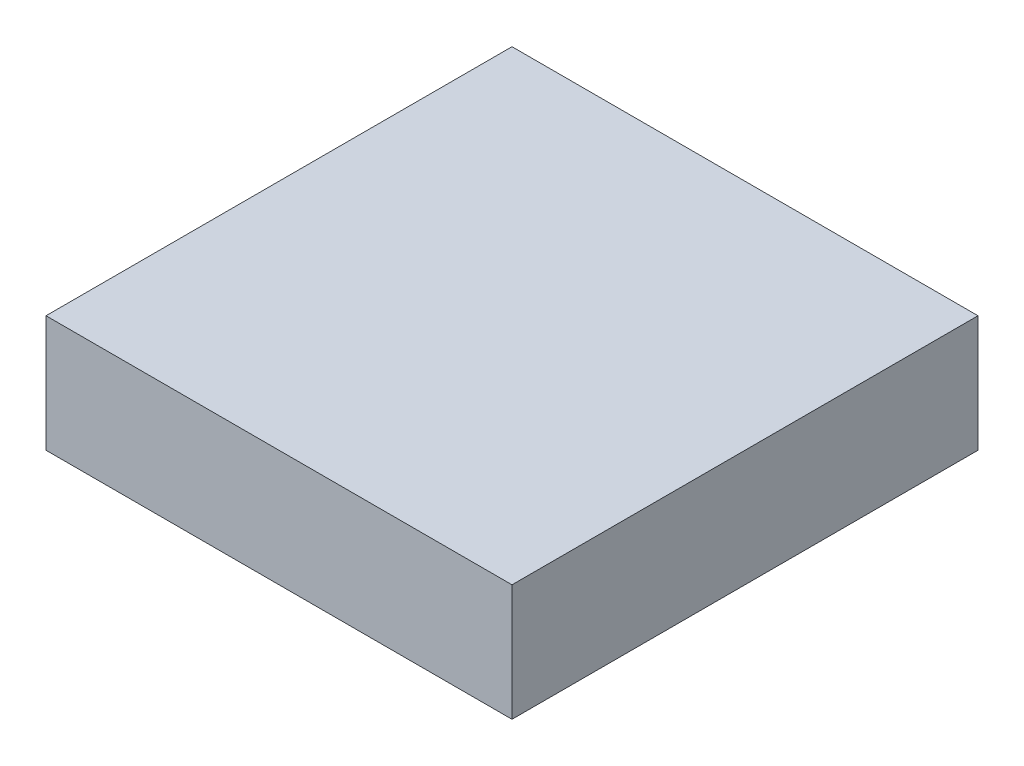
ISO-10303-21;
HEADER;
FILE_DESCRIPTION(('STEP AP214'),'2;1');
FILE_NAME('part.step','',(''),(''),'','','');
FILE_SCHEMA(('AUTOMOTIVE_DESIGN { 1 0 10303 214 1 1 1 1 }'));
ENDSEC;
DATA;
#1=APPLICATION_CONTEXT('core data for automotive mechanical design processes');
#2=APPLICATION_PROTOCOL_DEFINITION('international standard','automotive_design',2000,#1);
#3=PRODUCT_CONTEXT('',#1,'mechanical');
#4=PRODUCT('Part','Part','',(#3));
#5=PRODUCT_RELATED_PRODUCT_CATEGORY('part','',(#4));
#6=PRODUCT_DEFINITION_FORMATION('','',#4);
#7=PRODUCT_DEFINITION_CONTEXT('part definition',#1,'design');
#8=PRODUCT_DEFINITION('design','',#6,#7);
#9=PRODUCT_DEFINITION_SHAPE('','',#8);
#10=(LENGTH_UNIT() NAMED_UNIT(*) SI_UNIT(.MILLI.,.METRE.));
#11=(NAMED_UNIT(*) PLANE_ANGLE_UNIT() SI_UNIT($,.RADIAN.));
#12=(NAMED_UNIT(*) SI_UNIT($,.STERADIAN.) SOLID_ANGLE_UNIT());
#13=UNCERTAINTY_MEASURE_WITH_UNIT(LENGTH_MEASURE(1.E-05),#10,'distance_accuracy_value','');
#14=(GEOMETRIC_REPRESENTATION_CONTEXT(3) GLOBAL_UNCERTAINTY_ASSIGNED_CONTEXT((#13)) GLOBAL_UNIT_ASSIGNED_CONTEXT((#10,
#11,#12)) REPRESENTATION_CONTEXT('',''));
#15=CARTESIAN_POINT('',(0.,0.,0.));
#16=DIRECTION('',(0.,0.,1.));
#17=DIRECTION('',(1.,0.,0.));
#18=AXIS2_PLACEMENT_3D('',#15,#16,#17);
#19=CARTESIAN_POINT('',(505.459999999999,57.15,-1013.46));
#20=DIRECTION('',(0.,0.,1.));
#21=DIRECTION('',(-1.,0.,0.));
#22=AXIS2_PLACEMENT_3D('',#19,#20,#21);
#23=PLANE('',#22);
#24=DIRECTION('',(-1.,0.,0.));
#25=VECTOR('',#24,1.);
#26=CARTESIAN_POINT('',(505.459999999999,76.2,-1013.46));
#27=LINE('',#26,#25);
#28=CARTESIAN_POINT('',(505.459999999999,76.2,-1013.46));
#29=VERTEX_POINT('',#28);
#30=CARTESIAN_POINT('',(429.259999999999,76.2,-1013.46));
#31=VERTEX_POINT('',#30);
#32=EDGE_CURVE('E101',#29,#31,#27,.T.);
#33=ORIENTED_EDGE('',*,*,#32,.F.);
#34=DIRECTION('',(0.,1.,0.));
#35=VECTOR('',#34,1.);
#36=CARTESIAN_POINT('',(505.459999999999,57.15,-1013.46));
#37=LINE('',#36,#35);
#38=CARTESIAN_POINT('',(505.459999999999,57.15,-1013.46));
#39=VERTEX_POINT('',#38);
#40=EDGE_CURVE('E100',#39,#29,#37,.T.);
#41=ORIENTED_EDGE('',*,*,#40,.F.);
#42=DIRECTION('',(-1.,0.,0.));
#43=VECTOR('',#42,1.);
#44=CARTESIAN_POINT('',(505.459999999999,57.15,-1013.46));
#45=LINE('',#44,#43);
#46=CARTESIAN_POINT('',(429.259999999999,57.15,-1013.46));
#47=VERTEX_POINT('',#46);
#48=EDGE_CURVE('E95',#39,#47,#45,.T.);
#49=ORIENTED_EDGE('',*,*,#48,.T.);
#50=DIRECTION('',(0.,1.,0.));
#51=VECTOR('',#50,1.);
#52=CARTESIAN_POINT('',(429.259999999999,57.15,-1013.46));
#53=LINE('',#52,#51);
#54=EDGE_CURVE('E11',#47,#31,#53,.T.);
#55=ORIENTED_EDGE('',*,*,#54,.T.);
#56=EDGE_LOOP('',(#33,#41,#49,#55));
#57=FACE_BOUND('',#56,.T.);
#58=ADVANCED_FACE('F38',(#57),#23,.F.);
#59=CARTESIAN_POINT('',(429.26,57.15,-937.26));
#60=DIRECTION('',(1.,0.,0.));
#61=DIRECTION('',(0.,0.,1.));
#62=AXIS2_PLACEMENT_3D('',#59,#60,#61);
#63=PLANE('',#62);
#64=DIRECTION('',(0.,0.,1.));
#65=VECTOR('',#64,1.);
#66=CARTESIAN_POINT('',(429.26,76.2,-937.26));
#67=LINE('',#66,#65);
#68=CARTESIAN_POINT('',(429.26,76.2,-937.26));
#69=VERTEX_POINT('',#68);
#70=EDGE_CURVE('E103',#31,#69,#67,.T.);
#71=ORIENTED_EDGE('',*,*,#70,.F.);
#72=ORIENTED_EDGE('',*,*,#54,.F.);
#73=DIRECTION('',(0.,0.,1.));
#74=VECTOR('',#73,1.);
#75=CARTESIAN_POINT('',(429.259999999999,57.15,-1013.46));
#76=LINE('',#75,#74);
#77=CARTESIAN_POINT('',(429.26,57.15,-937.26));
#78=VERTEX_POINT('',#77);
#79=EDGE_CURVE('E79',#47,#78,#76,.T.);
#80=ORIENTED_EDGE('',*,*,#79,.T.);
#81=DIRECTION('',(0.,1.,0.));
#82=VECTOR('',#81,1.);
#83=CARTESIAN_POINT('',(429.26,57.15,-937.26));
#84=LINE('',#83,#82);
#85=EDGE_CURVE('E46',#78,#69,#84,.T.);
#86=ORIENTED_EDGE('',*,*,#85,.T.);
#87=EDGE_LOOP('',(#71,#72,#80,#86));
#88=FACE_BOUND('',#87,.T.);
#89=ADVANCED_FACE('F93',(#88),#63,.F.);
#90=CARTESIAN_POINT('',(505.459999999999,57.15,-937.26));
#91=DIRECTION('',(0.,0.,-1.));
#92=DIRECTION('',(1.,0.,0.));
#93=AXIS2_PLACEMENT_3D('',#90,#91,#92);
#94=PLANE('',#93);
#95=DIRECTION('',(1.,0.,0.));
#96=VECTOR('',#95,1.);
#97=CARTESIAN_POINT('',(505.459999999999,76.2,-937.26));
#98=LINE('',#97,#96);
#99=CARTESIAN_POINT('',(505.459999999999,76.2,-937.26));
#100=VERTEX_POINT('',#99);
#101=EDGE_CURVE('E89',#69,#100,#98,.T.);
#102=ORIENTED_EDGE('',*,*,#101,.F.);
#103=ORIENTED_EDGE('',*,*,#85,.F.);
#104=DIRECTION('',(1.,0.,0.));
#105=VECTOR('',#104,1.);
#106=CARTESIAN_POINT('',(429.26,57.15,-937.26));
#107=LINE('',#106,#105);
#108=CARTESIAN_POINT('',(505.459999999999,57.15,-937.26));
#109=VERTEX_POINT('',#108);
#110=EDGE_CURVE('E82',#78,#109,#107,.T.);
#111=ORIENTED_EDGE('',*,*,#110,.T.);
#112=DIRECTION('',(0.,1.,0.));
#113=VECTOR('',#112,1.);
#114=CARTESIAN_POINT('',(505.459999999999,57.15,-937.26));
#115=LINE('',#114,#113);
#116=EDGE_CURVE('E92',#109,#100,#115,.T.);
#117=ORIENTED_EDGE('',*,*,#116,.T.);
#118=EDGE_LOOP('',(#102,#103,#111,#117));
#119=FACE_BOUND('',#118,.T.);
#120=ADVANCED_FACE('F88',(#119),#94,.F.);
#121=CARTESIAN_POINT('',(505.459999999999,57.15,-1013.46));
#122=DIRECTION('',(-1.,0.,0.));
#123=DIRECTION('',(0.,0.,-1.));
#124=AXIS2_PLACEMENT_3D('',#121,#122,#123);
#125=PLANE('',#124);
#126=DIRECTION('',(0.,0.,-1.));
#127=VECTOR('',#126,1.);
#128=CARTESIAN_POINT('',(505.459999999999,76.2,-1013.46));
#129=LINE('',#128,#127);
#130=EDGE_CURVE('E68',#100,#29,#129,.T.);
#131=ORIENTED_EDGE('',*,*,#130,.F.);
#132=ORIENTED_EDGE('',*,*,#116,.F.);
#133=DIRECTION('',(0.,0.,-1.));
#134=VECTOR('',#133,1.);
#135=CARTESIAN_POINT('',(505.459999999999,57.15,-1013.46));
#136=LINE('',#135,#134);
#137=EDGE_CURVE('E54',#109,#39,#136,.T.);
#138=ORIENTED_EDGE('',*,*,#137,.T.);
#139=ORIENTED_EDGE('',*,*,#40,.T.);
#140=EDGE_LOOP('',(#131,#132,#138,#139));
#141=FACE_BOUND('',#140,.T.);
#142=ADVANCED_FACE('F112',(#141),#125,.F.);
#143=CARTESIAN_POINT('',(0.,57.15,0.));
#144=DIRECTION('',(0.,-1.,0.));
#145=DIRECTION('',(0.,0.,1.));
#146=AXIS2_PLACEMENT_3D('',#143,#144,#145);
#147=PLANE('',#146);
#148=ORIENTED_EDGE('',*,*,#48,.F.);
#149=ORIENTED_EDGE('',*,*,#137,.F.);
#150=ORIENTED_EDGE('',*,*,#110,.F.);
#151=ORIENTED_EDGE('',*,*,#79,.F.);
#152=EDGE_LOOP('',(#148,#149,#150,#151));
#153=FACE_BOUND('',#152,.T.);
#154=ADVANCED_FACE('F84',(#153),#147,.T.);
#155=CARTESIAN_POINT('',(0.,76.2,0.));
#156=DIRECTION('',(0.,-1.,0.));
#157=DIRECTION('',(0.,0.,1.));
#158=AXIS2_PLACEMENT_3D('',#155,#156,#157);
#159=PLANE('',#158);
#160=ORIENTED_EDGE('',*,*,#32,.T.);
#161=ORIENTED_EDGE('',*,*,#70,.T.);
#162=ORIENTED_EDGE('',*,*,#101,.T.);
#163=ORIENTED_EDGE('',*,*,#130,.T.);
#164=EDGE_LOOP('',(#160,#161,#162,#163));
#165=FACE_BOUND('',#164,.T.);
#166=ADVANCED_FACE('F108',(#165),#159,.F.);
#167=CLOSED_SHELL('',(#58,#89,#120,#142,#154,#166));
#168=MANIFOLD_SOLID_BREP('B2',#167);
#169=ADVANCED_BREP_SHAPE_REPRESENTATION('',(#18,#168),#14);
#170=SHAPE_DEFINITION_REPRESENTATION(#9,#169);
ENDSEC;
END-ISO-10303-21;
